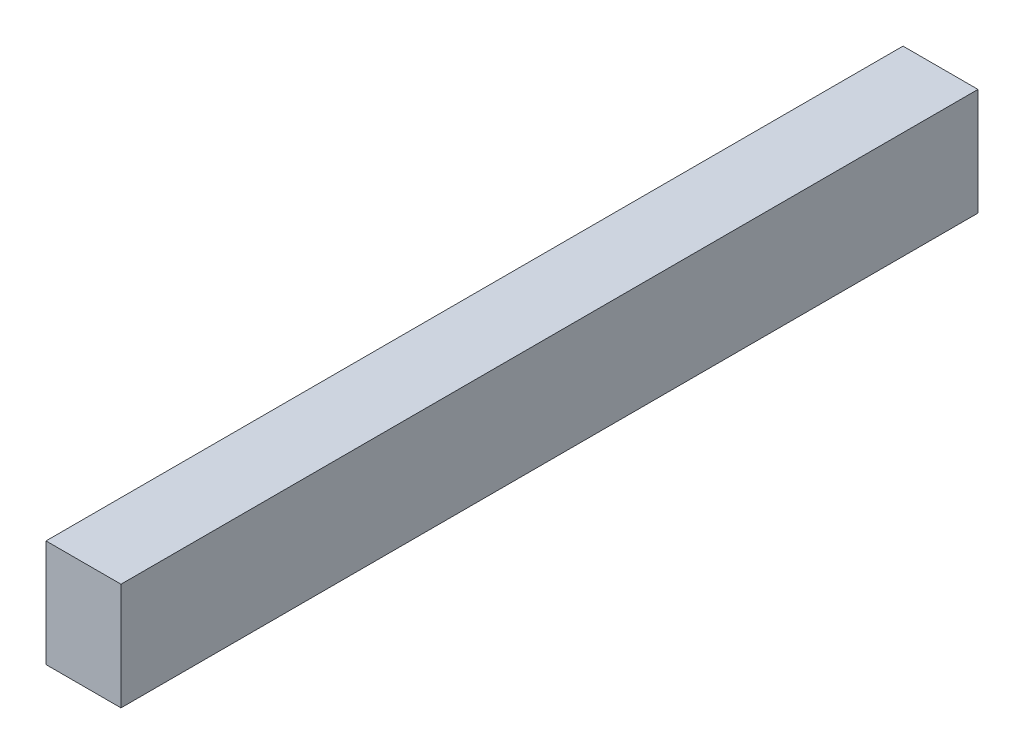
ISO-10303-21;
HEADER;
FILE_DESCRIPTION(('STEP AP214'),'2;1');
FILE_NAME('part.step','',(''),(''),'','','');
FILE_SCHEMA(('AUTOMOTIVE_DESIGN { 1 0 10303 214 1 1 1 1 }'));
ENDSEC;
DATA;
#1=APPLICATION_CONTEXT('core data for automotive mechanical design processes');
#2=APPLICATION_PROTOCOL_DEFINITION('international standard','automotive_design',2000,#1);
#3=PRODUCT_CONTEXT('',#1,'mechanical');
#4=PRODUCT('Part','Part','',(#3));
#5=PRODUCT_RELATED_PRODUCT_CATEGORY('part','',(#4));
#6=PRODUCT_DEFINITION_FORMATION('','',#4);
#7=PRODUCT_DEFINITION_CONTEXT('part definition',#1,'design');
#8=PRODUCT_DEFINITION('design','',#6,#7);
#9=PRODUCT_DEFINITION_SHAPE('','',#8);
#10=(LENGTH_UNIT() NAMED_UNIT(*) SI_UNIT(.MILLI.,.METRE.));
#11=(NAMED_UNIT(*) PLANE_ANGLE_UNIT() SI_UNIT($,.RADIAN.));
#12=(NAMED_UNIT(*) SI_UNIT($,.STERADIAN.) SOLID_ANGLE_UNIT());
#13=UNCERTAINTY_MEASURE_WITH_UNIT(LENGTH_MEASURE(1.E-05),#10,'distance_accuracy_value','');
#14=(GEOMETRIC_REPRESENTATION_CONTEXT(3) GLOBAL_UNCERTAINTY_ASSIGNED_CONTEXT((#13)) GLOBAL_UNIT_ASSIGNED_CONTEXT((#10,
#11,#12)) REPRESENTATION_CONTEXT('',''));
#15=CARTESIAN_POINT('',(0.,0.,0.));
#16=DIRECTION('',(0.,0.,1.));
#17=DIRECTION('',(1.,0.,0.));
#18=AXIS2_PLACEMENT_3D('',#15,#16,#17);
#19=CARTESIAN_POINT('',(0.,0.,80.));
#20=DIRECTION('',(1.,0.,0.));
#21=DIRECTION('',(0.,0.,-1.));
#22=AXIS2_PLACEMENT_3D('',#19,#20,#21);
#23=PLANE('',#22);
#24=DIRECTION('',(0.,-1.,0.));
#25=VECTOR('',#24,1.);
#26=CARTESIAN_POINT('',(0.,0.,0.));
#27=LINE('',#26,#25);
#28=CARTESIAN_POINT('',(0.,10.,0.));
#29=VERTEX_POINT('',#28);
#30=CARTESIAN_POINT('',(0.,0.,0.));
#31=VERTEX_POINT('',#30);
#32=EDGE_CURVE('E100',#29,#31,#27,.T.);
#33=ORIENTED_EDGE('',*,*,#32,.T.);
#34=DIRECTION('',(0.,0.,-1.));
#35=VECTOR('',#34,1.);
#36=CARTESIAN_POINT('',(0.,0.,80.));
#37=LINE('',#36,#35);
#38=CARTESIAN_POINT('',(0.,0.,80.));
#39=VERTEX_POINT('',#38);
#40=EDGE_CURVE('E11',#39,#31,#37,.T.);
#41=ORIENTED_EDGE('',*,*,#40,.F.);
#42=DIRECTION('',(0.,-1.,0.));
#43=VECTOR('',#42,1.);
#44=CARTESIAN_POINT('',(0.,0.,80.));
#45=LINE('',#44,#43);
#46=CARTESIAN_POINT('',(0.,10.,80.));
#47=VERTEX_POINT('',#46);
#48=EDGE_CURVE('E88',#47,#39,#45,.T.);
#49=ORIENTED_EDGE('',*,*,#48,.F.);
#50=DIRECTION('',(0.,0.,-1.));
#51=VECTOR('',#50,1.);
#52=CARTESIAN_POINT('',(0.,10.,80.));
#53=LINE('',#52,#51);
#54=EDGE_CURVE('E96',#47,#29,#53,.T.);
#55=ORIENTED_EDGE('',*,*,#54,.T.);
#56=EDGE_LOOP('',(#33,#41,#49,#55));
#57=FACE_BOUND('',#56,.T.);
#58=ADVANCED_FACE('F37',(#57),#23,.F.);
#59=CARTESIAN_POINT('',(0.,0.,80.));
#60=DIRECTION('',(0.,1.,0.));
#61=DIRECTION('',(0.,0.,1.));
#62=AXIS2_PLACEMENT_3D('',#59,#60,#61);
#63=PLANE('',#62);
#64=DIRECTION('',(1.,0.,0.));
#65=VECTOR('',#64,1.);
#66=CARTESIAN_POINT('',(0.,0.,0.));
#67=LINE('',#66,#65);
#68=CARTESIAN_POINT('',(7.,0.,0.));
#69=VERTEX_POINT('',#68);
#70=EDGE_CURVE('E92',#31,#69,#67,.T.);
#71=ORIENTED_EDGE('',*,*,#70,.T.);
#72=DIRECTION('',(0.,0.,-1.));
#73=VECTOR('',#72,1.);
#74=CARTESIAN_POINT('',(7.,0.,80.));
#75=LINE('',#74,#73);
#76=CARTESIAN_POINT('',(7.,0.,80.));
#77=VERTEX_POINT('',#76);
#78=EDGE_CURVE('E45',#77,#69,#75,.T.);
#79=ORIENTED_EDGE('',*,*,#78,.F.);
#80=DIRECTION('',(1.,0.,0.));
#81=VECTOR('',#80,1.);
#82=CARTESIAN_POINT('',(0.,0.,80.));
#83=LINE('',#82,#81);
#84=EDGE_CURVE('E83',#39,#77,#83,.T.);
#85=ORIENTED_EDGE('',*,*,#84,.F.);
#86=ORIENTED_EDGE('',*,*,#40,.T.);
#87=EDGE_LOOP('',(#71,#79,#85,#86));
#88=FACE_BOUND('',#87,.T.);
#89=ADVANCED_FACE('F91',(#88),#63,.F.);
#90=CARTESIAN_POINT('',(7.,0.,80.));
#91=DIRECTION('',(-1.,0.,0.));
#92=DIRECTION('',(0.,0.,1.));
#93=AXIS2_PLACEMENT_3D('',#90,#91,#92);
#94=PLANE('',#93);
#95=DIRECTION('',(0.,1.,0.));
#96=VECTOR('',#95,1.);
#97=CARTESIAN_POINT('',(7.,0.,0.));
#98=LINE('',#97,#96);
#99=CARTESIAN_POINT('',(7.,10.,0.));
#100=VERTEX_POINT('',#99);
#101=EDGE_CURVE('E70',#69,#100,#98,.T.);
#102=ORIENTED_EDGE('',*,*,#101,.T.);
#103=DIRECTION('',(0.,0.,-1.));
#104=VECTOR('',#103,1.);
#105=CARTESIAN_POINT('',(7.,10.,80.));
#106=LINE('',#105,#104);
#107=CARTESIAN_POINT('',(7.,10.,80.));
#108=VERTEX_POINT('',#107);
#109=EDGE_CURVE('E93',#108,#100,#106,.T.);
#110=ORIENTED_EDGE('',*,*,#109,.F.);
#111=DIRECTION('',(0.,1.,0.));
#112=VECTOR('',#111,1.);
#113=CARTESIAN_POINT('',(7.,0.,80.));
#114=LINE('',#113,#112);
#115=EDGE_CURVE('E86',#77,#108,#114,.T.);
#116=ORIENTED_EDGE('',*,*,#115,.F.);
#117=ORIENTED_EDGE('',*,*,#78,.T.);
#118=EDGE_LOOP('',(#102,#110,#116,#117));
#119=FACE_BOUND('',#118,.T.);
#120=ADVANCED_FACE('F94',(#119),#94,.F.);
#121=CARTESIAN_POINT('',(0.,10.,80.));
#122=DIRECTION('',(0.,-1.,0.));
#123=DIRECTION('',(0.,0.,-1.));
#124=AXIS2_PLACEMENT_3D('',#121,#122,#123);
#125=PLANE('',#124);
#126=DIRECTION('',(-1.,0.,0.));
#127=VECTOR('',#126,1.);
#128=CARTESIAN_POINT('',(0.,10.,0.));
#129=LINE('',#128,#127);
#130=EDGE_CURVE('E76',#100,#29,#129,.T.);
#131=ORIENTED_EDGE('',*,*,#130,.T.);
#132=ORIENTED_EDGE('',*,*,#54,.F.);
#133=DIRECTION('',(-1.,0.,0.));
#134=VECTOR('',#133,1.);
#135=CARTESIAN_POINT('',(0.,10.,80.));
#136=LINE('',#135,#134);
#137=EDGE_CURVE('E53',#108,#47,#136,.T.);
#138=ORIENTED_EDGE('',*,*,#137,.F.);
#139=ORIENTED_EDGE('',*,*,#109,.T.);
#140=EDGE_LOOP('',(#131,#132,#138,#139));
#141=FACE_BOUND('',#140,.T.);
#142=ADVANCED_FACE('F107',(#141),#125,.F.);
#143=CARTESIAN_POINT('',(0.,0.,80.));
#144=DIRECTION('',(0.,0.,-1.));
#145=DIRECTION('',(-1.,0.,0.));
#146=AXIS2_PLACEMENT_3D('',#143,#144,#145);
#147=PLANE('',#146);
#148=ORIENTED_EDGE('',*,*,#48,.T.);
#149=ORIENTED_EDGE('',*,*,#84,.T.);
#150=ORIENTED_EDGE('',*,*,#115,.T.);
#151=ORIENTED_EDGE('',*,*,#137,.T.);
#152=EDGE_LOOP('',(#148,#149,#150,#151));
#153=FACE_BOUND('',#152,.T.);
#154=ADVANCED_FACE('F84',(#153),#147,.F.);
#155=CARTESIAN_POINT('',(0.,0.,0.));
#156=DIRECTION('',(0.,0.,-1.));
#157=DIRECTION('',(-1.,0.,0.));
#158=AXIS2_PLACEMENT_3D('',#155,#156,#157);
#159=PLANE('',#158);
#160=ORIENTED_EDGE('',*,*,#32,.F.);
#161=ORIENTED_EDGE('',*,*,#130,.F.);
#162=ORIENTED_EDGE('',*,*,#101,.F.);
#163=ORIENTED_EDGE('',*,*,#70,.F.);
#164=EDGE_LOOP('',(#160,#161,#162,#163));
#165=FACE_BOUND('',#164,.T.);
#166=ADVANCED_FACE('F110',(#165),#159,.T.);
#167=CLOSED_SHELL('',(#58,#89,#120,#142,#154,#166));
#168=MANIFOLD_SOLID_BREP('B2',#167);
#169=ADVANCED_BREP_SHAPE_REPRESENTATION('',(#18,#168),#14);
#170=SHAPE_DEFINITION_REPRESENTATION(#9,#169);
ENDSEC;
END-ISO-10303-21;
